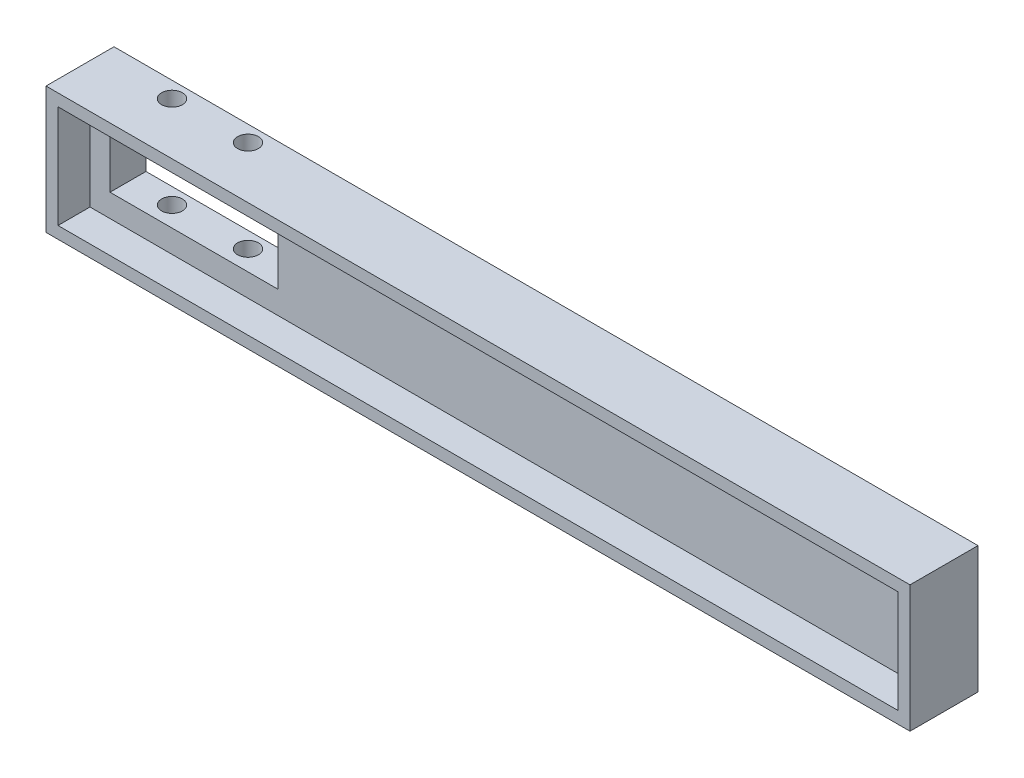
ISO-10303-21;
HEADER;
FILE_DESCRIPTION(('STEP AP214'),'2;1');
FILE_NAME('part.step','',(''),(''),'','','');
FILE_SCHEMA(('AUTOMOTIVE_DESIGN { 1 0 10303 214 1 1 1 1 }'));
ENDSEC;
DATA;
#1=APPLICATION_CONTEXT('core data for automotive mechanical design processes');
#2=APPLICATION_PROTOCOL_DEFINITION('international standard','automotive_design',2000,#1);
#3=PRODUCT_CONTEXT('',#1,'mechanical');
#4=PRODUCT('Part','Part','',(#3));
#5=PRODUCT_RELATED_PRODUCT_CATEGORY('part','',(#4));
#6=PRODUCT_DEFINITION_FORMATION('','',#4);
#7=PRODUCT_DEFINITION_CONTEXT('part definition',#1,'design');
#8=PRODUCT_DEFINITION('design','',#6,#7);
#9=PRODUCT_DEFINITION_SHAPE('','',#8);
#10=(LENGTH_UNIT() NAMED_UNIT(*) SI_UNIT(.MILLI.,.METRE.));
#11=(NAMED_UNIT(*) PLANE_ANGLE_UNIT() SI_UNIT($,.RADIAN.));
#12=(NAMED_UNIT(*) SI_UNIT($,.STERADIAN.) SOLID_ANGLE_UNIT());
#13=UNCERTAINTY_MEASURE_WITH_UNIT(LENGTH_MEASURE(1.E-05),#10,'distance_accuracy_value','');
#14=(GEOMETRIC_REPRESENTATION_CONTEXT(3) GLOBAL_UNCERTAINTY_ASSIGNED_CONTEXT((#13)) GLOBAL_UNIT_ASSIGNED_CONTEXT((#10,
#11,#12)) REPRESENTATION_CONTEXT('',''));
#15=CARTESIAN_POINT('',(0.,0.,0.));
#16=DIRECTION('',(0.,0.,1.));
#17=DIRECTION('',(1.,0.,0.));
#18=AXIS2_PLACEMENT_3D('',#15,#16,#17);
#19=CARTESIAN_POINT('',(-104.5,0.,-3.5));
#20=DIRECTION('',(-1.,0.,0.));
#21=DIRECTION('',(0.,0.,1.));
#22=AXIS2_PLACEMENT_3D('',#19,#20,#21);
#23=PLANE('',#22);
#24=DIRECTION('',(0.,0.,1.));
#25=VECTOR('',#24,1.);
#26=CARTESIAN_POINT('',(-104.5,4.04114391143853,-3.5));
#27=LINE('',#26,#25);
#28=CARTESIAN_POINT('',(-104.5,4.04114391143853,1.));
#29=VERTEX_POINT('',#28);
#30=CARTESIAN_POINT('',(-104.5,4.04114391143853,5.));
#31=VERTEX_POINT('',#30);
#32=EDGE_CURVE('E11',#29,#31,#27,.T.);
#33=ORIENTED_EDGE('',*,*,#32,.F.);
#34=DIRECTION('',(0.,-1.,0.));
#35=VECTOR('',#34,1.);
#36=CARTESIAN_POINT('',(-104.5,0.,1.));
#37=LINE('',#36,#35);
#38=CARTESIAN_POINT('',(-104.5,16.8911439114385,1.));
#39=VERTEX_POINT('',#38);
#40=EDGE_CURVE('E139',#39,#29,#37,.T.);
#41=ORIENTED_EDGE('',*,*,#40,.F.);
#42=DIRECTION('',(0.,0.,1.));
#43=VECTOR('',#42,1.);
#44=CARTESIAN_POINT('',(-104.5,16.8911439114385,-3.5));
#45=LINE('',#44,#43);
#46=CARTESIAN_POINT('',(-104.5,16.8911439114385,5.));
#47=VERTEX_POINT('',#46);
#48=EDGE_CURVE('E125',#39,#47,#45,.T.);
#49=ORIENTED_EDGE('',*,*,#48,.T.);
#50=DIRECTION('',(0.,-1.,0.));
#51=VECTOR('',#50,1.);
#52=CARTESIAN_POINT('',(-104.5,0.,5.));
#53=LINE('',#52,#51);
#54=EDGE_CURVE('E194',#47,#31,#53,.T.);
#55=ORIENTED_EDGE('',*,*,#54,.T.);
#56=EDGE_LOOP('',(#33,#41,#49,#55));
#57=FACE_BOUND('',#56,.T.);
#58=ADVANCED_FACE('F35',(#57),#23,.F.);
#59=CARTESIAN_POINT('',(0.,4.04114391143857,-3.5));
#60=DIRECTION('',(0.,1.,0.));
#61=DIRECTION('',(-1.,0.,0.));
#62=AXIS2_PLACEMENT_3D('',#59,#60,#61);
#63=PLANE('',#62);
#64=DIRECTION('',(1.,0.,0.));
#65=VECTOR('',#64,1.);
#66=CARTESIAN_POINT('',(0.,4.04114391143861,1.));
#67=LINE('',#66,#65);
#68=CARTESIAN_POINT('',(0.500000000000003,4.04114391143857,1.));
#69=VERTEX_POINT('',#68);
#70=EDGE_CURVE('E51',#29,#69,#67,.T.);
#71=ORIENTED_EDGE('',*,*,#70,.F.);
#72=ORIENTED_EDGE('',*,*,#32,.T.);
#73=DIRECTION('',(-1.,0.,0.));
#74=VECTOR('',#73,1.);
#75=CARTESIAN_POINT('',(0.,4.04114391143857,5.));
#76=LINE('',#75,#74);
#77=CARTESIAN_POINT('',(0.500000000000003,4.04114391143857,5.));
#78=VERTEX_POINT('',#77);
#79=EDGE_CURVE('E200',#78,#31,#76,.T.);
#80=ORIENTED_EDGE('',*,*,#79,.F.);
#81=DIRECTION('',(0.,0.,1.));
#82=VECTOR('',#81,1.);
#83=CARTESIAN_POINT('',(0.500000000000003,4.04114391143857,-3.5));
#84=LINE('',#83,#82);
#85=EDGE_CURVE('E44',#69,#78,#84,.T.);
#86=ORIENTED_EDGE('',*,*,#85,.F.);
#87=EDGE_LOOP('',(#71,#72,#80,#86));
#88=FACE_BOUND('',#87,.T.);
#89=ADVANCED_FACE('F286',(#88),#63,.T.);
#90=CARTESIAN_POINT('',(0.500000000000003,0.,-3.5));
#91=DIRECTION('',(-1.,0.,0.));
#92=DIRECTION('',(0.,-1.,0.));
#93=AXIS2_PLACEMENT_3D('',#90,#91,#92);
#94=PLANE('',#93);
#95=DIRECTION('',(0.,-1.,0.));
#96=VECTOR('',#95,1.);
#97=CARTESIAN_POINT('',(0.500000000000003,0.,1.));
#98=LINE('',#97,#96);
#99=CARTESIAN_POINT('',(0.5,16.8911439114385,1.));
#100=VERTEX_POINT('',#99);
#101=EDGE_CURVE('E59',#100,#69,#98,.T.);
#102=ORIENTED_EDGE('',*,*,#101,.T.);
#103=ORIENTED_EDGE('',*,*,#85,.T.);
#104=DIRECTION('',(0.,-1.,0.));
#105=VECTOR('',#104,1.);
#106=CARTESIAN_POINT('',(0.500000000000003,0.,5.));
#107=LINE('',#106,#105);
#108=CARTESIAN_POINT('',(0.5,16.8911439114385,5.));
#109=VERTEX_POINT('',#108);
#110=EDGE_CURVE('E197',#109,#78,#107,.T.);
#111=ORIENTED_EDGE('',*,*,#110,.F.);
#112=DIRECTION('',(0.,0.,1.));
#113=VECTOR('',#112,1.);
#114=CARTESIAN_POINT('',(0.5,16.8911439114385,-3.5));
#115=LINE('',#114,#113);
#116=EDGE_CURVE('E135',#100,#109,#115,.T.);
#117=ORIENTED_EDGE('',*,*,#116,.F.);
#118=EDGE_LOOP('',(#102,#103,#111,#117));
#119=FACE_BOUND('',#118,.T.);
#120=ADVANCED_FACE('F291',(#119),#94,.T.);
#121=CARTESIAN_POINT('',(0.,18.3911439114386,-3.5));
#122=DIRECTION('',(0.,-1.,0.));
#123=DIRECTION('',(1.,0.,0.));
#124=AXIS2_PLACEMENT_3D('',#121,#122,#123);
#125=PLANE('',#124);
#126=CARTESIAN_POINT('',(-87.25,18.3911439114386,-1.5));
#127=DIRECTION('',(0.,1.,0.));
#128=DIRECTION('',(-1.,0.,0.));
#129=AXIS2_PLACEMENT_3D('',#126,#127,#128);
#130=CIRCLE('',#129,1.29999999999999);
#131=CARTESIAN_POINT('',(-88.55,18.3911439114386,-1.5));
#132=VERTEX_POINT('',#131);
#133=EDGE_CURVE('E236',#132,#132,#130,.F.);
#134=ORIENTED_EDGE('',*,*,#133,.T.);
#135=EDGE_LOOP('',(#134));
#136=FACE_BOUND('',#135,.T.);
#137=CARTESIAN_POINT('',(-96.75,18.3911439114386,-1.5));
#138=DIRECTION('',(0.,1.,0.));
#139=DIRECTION('',(-1.,0.,0.));
#140=AXIS2_PLACEMENT_3D('',#137,#138,#139);
#141=CIRCLE('',#140,1.29999999999999);
#142=CARTESIAN_POINT('',(-98.05,18.3911439114386,-1.5));
#143=VERTEX_POINT('',#142);
#144=EDGE_CURVE('E227',#143,#143,#141,.F.);
#145=ORIENTED_EDGE('',*,*,#144,.T.);
#146=EDGE_LOOP('',(#145));
#147=FACE_BOUND('',#146,.T.);
#148=DIRECTION('',(0.,0.,1.));
#149=VECTOR('',#148,1.);
#150=CARTESIAN_POINT('',(-106.,18.3911439114385,-3.5));
#151=LINE('',#150,#149);
#152=CARTESIAN_POINT('',(-106.,18.3911439114385,-3.5));
#153=VERTEX_POINT('',#152);
#154=CARTESIAN_POINT('',(-106.,18.3911439114385,5.));
#155=VERTEX_POINT('',#154);
#156=EDGE_CURVE('E213',#153,#155,#151,.T.);
#157=ORIENTED_EDGE('',*,*,#156,.T.);
#158=DIRECTION('',(1.,0.,0.));
#159=VECTOR('',#158,1.);
#160=CARTESIAN_POINT('',(0.,18.3911439114386,5.));
#161=LINE('',#160,#159);
#162=CARTESIAN_POINT('',(2.,18.3911439114386,5.));
#163=VERTEX_POINT('',#162);
#164=EDGE_CURVE('E177',#155,#163,#161,.T.);
#165=ORIENTED_EDGE('',*,*,#164,.T.);
#166=DIRECTION('',(0.,0.,1.));
#167=VECTOR('',#166,1.);
#168=CARTESIAN_POINT('',(2.,18.3911439114386,-3.5));
#169=LINE('',#168,#167);
#170=CARTESIAN_POINT('',(2.,18.3911439114386,-3.5));
#171=VERTEX_POINT('',#170);
#172=EDGE_CURVE('E136',#171,#163,#169,.T.);
#173=ORIENTED_EDGE('',*,*,#172,.F.);
#174=DIRECTION('',(1.,0.,0.));
#175=VECTOR('',#174,1.);
#176=CARTESIAN_POINT('',(0.,18.3911439114386,-3.5));
#177=LINE('',#176,#175);
#178=EDGE_CURVE('E203',#153,#171,#177,.T.);
#179=ORIENTED_EDGE('',*,*,#178,.F.);
#180=EDGE_LOOP('',(#157,#165,#173,#179));
#181=FACE_BOUND('',#180,.T.);
#182=ADVANCED_FACE('F37',(#136,#147,#181),#125,.F.);
#183=CARTESIAN_POINT('',(2.,0.,-3.5));
#184=DIRECTION('',(-1.,0.,0.));
#185=DIRECTION('',(0.,-1.,0.));
#186=AXIS2_PLACEMENT_3D('',#183,#184,#185);
#187=PLANE('',#186);
#188=ORIENTED_EDGE('',*,*,#172,.T.);
#189=DIRECTION('',(0.,-1.,0.));
#190=VECTOR('',#189,1.);
#191=CARTESIAN_POINT('',(2.,0.,5.));
#192=LINE('',#191,#190);
#193=CARTESIAN_POINT('',(2.,2.54114391143857,5.));
#194=VERTEX_POINT('',#193);
#195=EDGE_CURVE('E191',#163,#194,#192,.T.);
#196=ORIENTED_EDGE('',*,*,#195,.T.);
#197=DIRECTION('',(0.,0.,1.));
#198=VECTOR('',#197,1.);
#199=CARTESIAN_POINT('',(2.,2.54114391143857,-3.5));
#200=LINE('',#199,#198);
#201=CARTESIAN_POINT('',(2.,2.54114391143857,-3.5));
#202=VERTEX_POINT('',#201);
#203=EDGE_CURVE('E218',#202,#194,#200,.T.);
#204=ORIENTED_EDGE('',*,*,#203,.F.);
#205=DIRECTION('',(0.,-1.,0.));
#206=VECTOR('',#205,1.);
#207=CARTESIAN_POINT('',(2.,0.,-3.5));
#208=LINE('',#207,#206);
#209=EDGE_CURVE('E212',#171,#202,#208,.T.);
#210=ORIENTED_EDGE('',*,*,#209,.F.);
#211=EDGE_LOOP('',(#188,#196,#204,#210));
#212=FACE_BOUND('',#211,.T.);
#213=ADVANCED_FACE('F294',(#212),#187,.F.);
#214=CARTESIAN_POINT('',(0.,2.54114391143857,-3.5));
#215=DIRECTION('',(0.,-1.,0.));
#216=DIRECTION('',(1.,0.,0.));
#217=AXIS2_PLACEMENT_3D('',#214,#215,#216);
#218=PLANE('',#217);
#219=CARTESIAN_POINT('',(-87.25,2.54114391143849,-1.5));
#220=DIRECTION('',(0.,1.,0.));
#221=DIRECTION('',(-1.,0.,0.));
#222=AXIS2_PLACEMENT_3D('',#219,#220,#221);
#223=CIRCLE('',#222,1.29999999999999);
#224=CARTESIAN_POINT('',(-88.55,2.54114391143849,-1.5));
#225=VERTEX_POINT('',#224);
#226=EDGE_CURVE('E239',#225,#225,#223,.F.);
#227=ORIENTED_EDGE('',*,*,#226,.F.);
#228=EDGE_LOOP('',(#227));
#229=FACE_BOUND('',#228,.T.);
#230=CARTESIAN_POINT('',(-96.75,2.54114391143848,-1.5));
#231=DIRECTION('',(0.,1.,0.));
#232=DIRECTION('',(-1.,0.,0.));
#233=AXIS2_PLACEMENT_3D('',#230,#231,#232);
#234=CIRCLE('',#233,1.29999999999999);
#235=CARTESIAN_POINT('',(-98.05,2.54114391143848,-1.5));
#236=VERTEX_POINT('',#235);
#237=EDGE_CURVE('E223',#236,#236,#234,.F.);
#238=ORIENTED_EDGE('',*,*,#237,.F.);
#239=EDGE_LOOP('',(#238));
#240=FACE_BOUND('',#239,.T.);
#241=ORIENTED_EDGE('',*,*,#203,.T.);
#242=DIRECTION('',(1.,0.,0.));
#243=VECTOR('',#242,1.);
#244=CARTESIAN_POINT('',(0.,2.54114391143857,5.));
#245=LINE('',#244,#243);
#246=CARTESIAN_POINT('',(-106.,2.54114391143853,5.));
#247=VERTEX_POINT('',#246);
#248=EDGE_CURVE('E188',#247,#194,#245,.T.);
#249=ORIENTED_EDGE('',*,*,#248,.F.);
#250=DIRECTION('',(0.,0.,1.));
#251=VECTOR('',#250,1.);
#252=CARTESIAN_POINT('',(-106.,2.54114391143853,-3.5));
#253=LINE('',#252,#251);
#254=CARTESIAN_POINT('',(-106.,2.54114391143853,-3.5));
#255=VERTEX_POINT('',#254);
#256=EDGE_CURVE('E220',#255,#247,#253,.T.);
#257=ORIENTED_EDGE('',*,*,#256,.F.);
#258=DIRECTION('',(1.,0.,0.));
#259=VECTOR('',#258,1.);
#260=CARTESIAN_POINT('',(0.,2.54114391143857,-3.5));
#261=LINE('',#260,#259);
#262=EDGE_CURVE('E209',#255,#202,#261,.T.);
#263=ORIENTED_EDGE('',*,*,#262,.T.);
#264=EDGE_LOOP('',(#241,#249,#257,#263));
#265=FACE_BOUND('',#264,.T.);
#266=ADVANCED_FACE('F297',(#229,#240,#265),#218,.T.);
#267=CARTESIAN_POINT('',(-106.,0.,-3.5));
#268=DIRECTION('',(-1.,0.,0.));
#269=DIRECTION('',(0.,0.,1.));
#270=AXIS2_PLACEMENT_3D('',#267,#268,#269);
#271=PLANE('',#270);
#272=ORIENTED_EDGE('',*,*,#256,.T.);
#273=DIRECTION('',(0.,-1.,0.));
#274=VECTOR('',#273,1.);
#275=CARTESIAN_POINT('',(-106.,0.,5.));
#276=LINE('',#275,#274);
#277=EDGE_CURVE('E185',#155,#247,#276,.T.);
#278=ORIENTED_EDGE('',*,*,#277,.F.);
#279=ORIENTED_EDGE('',*,*,#156,.F.);
#280=DIRECTION('',(0.,-1.,0.));
#281=VECTOR('',#280,1.);
#282=CARTESIAN_POINT('',(-106.,0.,-3.5));
#283=LINE('',#282,#281);
#284=EDGE_CURVE('E206',#153,#255,#283,.T.);
#285=ORIENTED_EDGE('',*,*,#284,.T.);
#286=EDGE_LOOP('',(#272,#278,#279,#285));
#287=FACE_BOUND('',#286,.T.);
#288=ADVANCED_FACE('F282',(#287),#271,.T.);
#289=CARTESIAN_POINT('',(0.,16.8911439114383,-3.5));
#290=DIRECTION('',(0.,-1.,0.));
#291=DIRECTION('',(1.,0.,0.));
#292=AXIS2_PLACEMENT_3D('',#289,#290,#291);
#293=PLANE('',#292);
#294=DIRECTION('',(1.,0.,0.));
#295=VECTOR('',#294,1.);
#296=CARTESIAN_POINT('',(0.,16.8911439114383,1.));
#297=LINE('',#296,#295);
#298=EDGE_CURVE('E129',#39,#100,#297,.T.);
#299=ORIENTED_EDGE('',*,*,#298,.T.);
#300=ORIENTED_EDGE('',*,*,#116,.T.);
#301=DIRECTION('',(1.,0.,0.));
#302=VECTOR('',#301,1.);
#303=CARTESIAN_POINT('',(0.,16.8911439114383,5.));
#304=LINE('',#303,#302);
#305=EDGE_CURVE('E131',#47,#109,#304,.T.);
#306=ORIENTED_EDGE('',*,*,#305,.F.);
#307=ORIENTED_EDGE('',*,*,#48,.F.);
#308=EDGE_LOOP('',(#299,#300,#306,#307));
#309=FACE_BOUND('',#308,.T.);
#310=ADVANCED_FACE('F127',(#309),#293,.T.);
#311=CARTESIAN_POINT('',(0.,0.,-3.5));
#312=DIRECTION('',(0.,0.,1.));
#313=DIRECTION('',(1.,0.,0.));
#314=AXIS2_PLACEMENT_3D('',#311,#312,#313);
#315=PLANE('',#314);
#316=ORIENTED_EDGE('',*,*,#178,.T.);
#317=ORIENTED_EDGE('',*,*,#209,.T.);
#318=ORIENTED_EDGE('',*,*,#262,.F.);
#319=ORIENTED_EDGE('',*,*,#284,.F.);
#320=EDGE_LOOP('',(#316,#317,#318,#319));
#321=FACE_BOUND('',#320,.T.);
#322=DIRECTION('',(0.,1.,0.));
#323=VECTOR('',#322,1.);
#324=CARTESIAN_POINT('',(-81.0000000000001,0.,-3.5));
#325=LINE('',#324,#323);
#326=CARTESIAN_POINT('',(-81.0000000000001,6.89114391143846,-3.5));
#327=VERTEX_POINT('',#326);
#328=CARTESIAN_POINT('',(-81.0000000000001,14.3911439114385,-3.5));
#329=VERTEX_POINT('',#328);
#330=EDGE_CURVE('E165',#327,#329,#325,.T.);
#331=ORIENTED_EDGE('',*,*,#330,.T.);
#332=DIRECTION('',(1.,0.,0.));
#333=VECTOR('',#332,1.);
#334=CARTESIAN_POINT('',(0.,14.3911439114385,-3.5));
#335=LINE('',#334,#333);
#336=CARTESIAN_POINT('',(-102.,14.3911439114385,-3.5));
#337=VERTEX_POINT('',#336);
#338=EDGE_CURVE('E171',#337,#329,#335,.T.);
#339=ORIENTED_EDGE('',*,*,#338,.F.);
#340=DIRECTION('',(0.,-1.,0.));
#341=VECTOR('',#340,1.);
#342=CARTESIAN_POINT('',(-102.,0.,-3.5));
#343=LINE('',#342,#341);
#344=CARTESIAN_POINT('',(-102.,6.89114391143846,-3.5));
#345=VERTEX_POINT('',#344);
#346=EDGE_CURVE('E169',#337,#345,#343,.T.);
#347=ORIENTED_EDGE('',*,*,#346,.T.);
#348=DIRECTION('',(1.,0.,0.));
#349=VECTOR('',#348,1.);
#350=CARTESIAN_POINT('',(0.,6.89114391143847,-3.5));
#351=LINE('',#350,#349);
#352=EDGE_CURVE('E167',#345,#327,#351,.T.);
#353=ORIENTED_EDGE('',*,*,#352,.T.);
#354=EDGE_LOOP('',(#331,#339,#347,#353));
#355=FACE_BOUND('',#354,.T.);
#356=ADVANCED_FACE('F271',(#321,#355),#315,.F.);
#357=CARTESIAN_POINT('',(0.,0.,5.));
#358=DIRECTION('',(0.,0.,1.));
#359=DIRECTION('',(1.,0.,0.));
#360=AXIS2_PLACEMENT_3D('',#357,#358,#359);
#361=PLANE('',#360);
#362=ORIENTED_EDGE('',*,*,#164,.F.);
#363=ORIENTED_EDGE('',*,*,#277,.T.);
#364=ORIENTED_EDGE('',*,*,#248,.T.);
#365=ORIENTED_EDGE('',*,*,#195,.F.);
#366=EDGE_LOOP('',(#362,#363,#364,#365));
#367=FACE_BOUND('',#366,.T.);
#368=ORIENTED_EDGE('',*,*,#54,.F.);
#369=ORIENTED_EDGE('',*,*,#305,.T.);
#370=ORIENTED_EDGE('',*,*,#110,.T.);
#371=ORIENTED_EDGE('',*,*,#79,.T.);
#372=EDGE_LOOP('',(#368,#369,#370,#371));
#373=FACE_BOUND('',#372,.T.);
#374=ADVANCED_FACE('F273',(#367,#373),#361,.T.);
#375=CARTESIAN_POINT('',(-81.0000000000001,0.,-3.5));
#376=DIRECTION('',(1.,0.,0.));
#377=DIRECTION('',(0.,0.,-1.));
#378=AXIS2_PLACEMENT_3D('',#375,#376,#377);
#379=PLANE('',#378);
#380=DIRECTION('',(0.,0.,1.));
#381=VECTOR('',#380,1.);
#382=CARTESIAN_POINT('',(-81.0000000000001,6.89114391143846,-3.5));
#383=LINE('',#382,#381);
#384=CARTESIAN_POINT('',(-81.0000000000001,6.89114391143846,1.));
#385=VERTEX_POINT('',#384);
#386=EDGE_CURVE('E174',#327,#385,#383,.T.);
#387=ORIENTED_EDGE('',*,*,#386,.T.);
#388=DIRECTION('',(0.,1.,0.));
#389=VECTOR('',#388,1.);
#390=CARTESIAN_POINT('',(-81.0000000000001,0.,1.));
#391=LINE('',#390,#389);
#392=CARTESIAN_POINT('',(-81.0000000000001,14.3911439114385,1.));
#393=VERTEX_POINT('',#392);
#394=EDGE_CURVE('E153',#385,#393,#391,.T.);
#395=ORIENTED_EDGE('',*,*,#394,.T.);
#396=DIRECTION('',(0.,0.,1.));
#397=VECTOR('',#396,1.);
#398=CARTESIAN_POINT('',(-81.0000000000001,14.3911439114385,-3.5));
#399=LINE('',#398,#397);
#400=EDGE_CURVE('E175',#329,#393,#399,.T.);
#401=ORIENTED_EDGE('',*,*,#400,.F.);
#402=ORIENTED_EDGE('',*,*,#330,.F.);
#403=EDGE_LOOP('',(#387,#395,#401,#402));
#404=FACE_BOUND('',#403,.T.);
#405=ADVANCED_FACE('F268',(#404),#379,.F.);
#406=CARTESIAN_POINT('',(0.,14.3911439114385,-3.5));
#407=DIRECTION('',(0.,-1.,0.));
#408=DIRECTION('',(0.,0.,-1.));
#409=AXIS2_PLACEMENT_3D('',#406,#407,#408);
#410=PLANE('',#409);
#411=CARTESIAN_POINT('',(-87.25,14.3911439114385,-1.5));
#412=DIRECTION('',(0.,-1.,0.));
#413=DIRECTION('',(0.,0.,-1.));
#414=AXIS2_PLACEMENT_3D('',#411,#412,#413);
#415=CIRCLE('',#414,1.29999999999999);
#416=CARTESIAN_POINT('',(-87.25,14.3911439114385,-2.8));
#417=VERTEX_POINT('',#416);
#418=EDGE_CURVE('E232',#417,#417,#415,.F.);
#419=ORIENTED_EDGE('',*,*,#418,.T.);
#420=EDGE_LOOP('',(#419));
#421=FACE_BOUND('',#420,.T.);
#422=CARTESIAN_POINT('',(-96.75,14.3911439114385,-1.5));
#423=DIRECTION('',(0.,-1.,0.));
#424=DIRECTION('',(0.,0.,-1.));
#425=AXIS2_PLACEMENT_3D('',#422,#423,#424);
#426=CIRCLE('',#425,1.29999999999999);
#427=CARTESIAN_POINT('',(-96.75,14.3911439114385,-2.8));
#428=VERTEX_POINT('',#427);
#429=EDGE_CURVE('E144',#428,#428,#426,.F.);
#430=ORIENTED_EDGE('',*,*,#429,.T.);
#431=EDGE_LOOP('',(#430));
#432=FACE_BOUND('',#431,.T.);
#433=ORIENTED_EDGE('',*,*,#400,.T.);
#434=DIRECTION('',(1.,0.,0.));
#435=VECTOR('',#434,1.);
#436=CARTESIAN_POINT('',(0.,14.3911439114385,1.));
#437=LINE('',#436,#435);
#438=CARTESIAN_POINT('',(-102.,14.3911439114385,1.));
#439=VERTEX_POINT('',#438);
#440=EDGE_CURVE('E162',#439,#393,#437,.T.);
#441=ORIENTED_EDGE('',*,*,#440,.F.);
#442=DIRECTION('',(0.,0.,1.));
#443=VECTOR('',#442,1.);
#444=CARTESIAN_POINT('',(-102.,14.3911439114385,-3.5));
#445=LINE('',#444,#443);
#446=EDGE_CURVE('E178',#337,#439,#445,.T.);
#447=ORIENTED_EDGE('',*,*,#446,.F.);
#448=ORIENTED_EDGE('',*,*,#338,.T.);
#449=EDGE_LOOP('',(#433,#441,#447,#448));
#450=FACE_BOUND('',#449,.T.);
#451=ADVANCED_FACE('F265',(#421,#432,#450),#410,.T.);
#452=CARTESIAN_POINT('',(-102.,0.,-3.5));
#453=DIRECTION('',(-1.,0.,0.));
#454=DIRECTION('',(0.,0.,1.));
#455=AXIS2_PLACEMENT_3D('',#452,#453,#454);
#456=PLANE('',#455);
#457=ORIENTED_EDGE('',*,*,#446,.T.);
#458=DIRECTION('',(0.,-1.,0.));
#459=VECTOR('',#458,1.);
#460=CARTESIAN_POINT('',(-102.,0.,1.));
#461=LINE('',#460,#459);
#462=CARTESIAN_POINT('',(-102.,6.89114391143846,1.));
#463=VERTEX_POINT('',#462);
#464=EDGE_CURVE('E159',#439,#463,#461,.T.);
#465=ORIENTED_EDGE('',*,*,#464,.T.);
#466=DIRECTION('',(0.,0.,1.));
#467=VECTOR('',#466,1.);
#468=CARTESIAN_POINT('',(-102.,6.89114391143846,-3.5));
#469=LINE('',#468,#467);
#470=EDGE_CURVE('E180',#345,#463,#469,.T.);
#471=ORIENTED_EDGE('',*,*,#470,.F.);
#472=ORIENTED_EDGE('',*,*,#346,.F.);
#473=EDGE_LOOP('',(#457,#465,#471,#472));
#474=FACE_BOUND('',#473,.T.);
#475=ADVANCED_FACE('F251',(#474),#456,.F.);
#476=CARTESIAN_POINT('',(0.,6.89114391143847,-3.5));
#477=DIRECTION('',(0.,-1.,0.));
#478=DIRECTION('',(1.,0.,0.));
#479=AXIS2_PLACEMENT_3D('',#476,#477,#478);
#480=PLANE('',#479);
#481=CARTESIAN_POINT('',(-87.25,6.89114391143846,-1.5));
#482=DIRECTION('',(0.,-1.,0.));
#483=DIRECTION('',(1.,0.,0.));
#484=AXIS2_PLACEMENT_3D('',#481,#482,#483);
#485=CIRCLE('',#484,1.29999999999999);
#486=CARTESIAN_POINT('',(-85.95,6.89114391143846,-1.5));
#487=VERTEX_POINT('',#486);
#488=EDGE_CURVE('E39',#487,#487,#485,.F.);
#489=ORIENTED_EDGE('',*,*,#488,.F.);
#490=EDGE_LOOP('',(#489));
#491=FACE_BOUND('',#490,.T.);
#492=CARTESIAN_POINT('',(-96.75,6.89114391143846,-1.5));
#493=DIRECTION('',(0.,-1.,0.));
#494=DIRECTION('',(1.,0.,0.));
#495=AXIS2_PLACEMENT_3D('',#492,#493,#494);
#496=CIRCLE('',#495,1.29999999999999);
#497=CARTESIAN_POINT('',(-95.45,6.89114391143846,-1.5));
#498=VERTEX_POINT('',#497);
#499=EDGE_CURVE('E147',#498,#498,#496,.F.);
#500=ORIENTED_EDGE('',*,*,#499,.F.);
#501=EDGE_LOOP('',(#500));
#502=FACE_BOUND('',#501,.T.);
#503=ORIENTED_EDGE('',*,*,#470,.T.);
#504=DIRECTION('',(1.,0.,0.));
#505=VECTOR('',#504,1.);
#506=CARTESIAN_POINT('',(0.,6.89114391143847,1.));
#507=LINE('',#506,#505);
#508=EDGE_CURVE('E156',#463,#385,#507,.T.);
#509=ORIENTED_EDGE('',*,*,#508,.T.);
#510=ORIENTED_EDGE('',*,*,#386,.F.);
#511=ORIENTED_EDGE('',*,*,#352,.F.);
#512=EDGE_LOOP('',(#503,#509,#510,#511));
#513=FACE_BOUND('',#512,.T.);
#514=ADVANCED_FACE('F248',(#491,#502,#513),#480,.F.);
#515=CARTESIAN_POINT('',(0.,0.,1.));
#516=DIRECTION('',(0.,0.,1.));
#517=DIRECTION('',(1.,0.,0.));
#518=AXIS2_PLACEMENT_3D('',#515,#516,#517);
#519=PLANE('',#518);
#520=ORIENTED_EDGE('',*,*,#298,.F.);
#521=ORIENTED_EDGE('',*,*,#40,.T.);
#522=ORIENTED_EDGE('',*,*,#70,.T.);
#523=ORIENTED_EDGE('',*,*,#101,.F.);
#524=EDGE_LOOP('',(#520,#521,#522,#523));
#525=FACE_BOUND('',#524,.T.);
#526=ORIENTED_EDGE('',*,*,#394,.F.);
#527=ORIENTED_EDGE('',*,*,#508,.F.);
#528=ORIENTED_EDGE('',*,*,#464,.F.);
#529=ORIENTED_EDGE('',*,*,#440,.T.);
#530=EDGE_LOOP('',(#526,#527,#528,#529));
#531=FACE_BOUND('',#530,.T.);
#532=ADVANCED_FACE('F142',(#525,#531),#519,.T.);
#533=CARTESIAN_POINT('',(-96.75,2.54114391143848,-1.5));
#534=DIRECTION('',(0.,1.,0.));
#535=DIRECTION('',(-1.,0.,0.));
#536=AXIS2_PLACEMENT_3D('',#533,#534,#535);
#537=CYLINDRICAL_SURFACE('',#536,1.29999999999999);
#538=ORIENTED_EDGE('',*,*,#237,.T.);
#539=EDGE_LOOP('',(#538));
#540=FACE_BOUND('',#539,.T.);
#541=ORIENTED_EDGE('',*,*,#499,.T.);
#542=EDGE_LOOP('',(#541));
#543=FACE_BOUND('',#542,.T.);
#544=ADVANCED_FACE('F328',(#540,#543),#537,.F.);
#545=ORIENTED_EDGE('',*,*,#429,.F.);
#546=EDGE_LOOP('',(#545));
#547=FACE_BOUND('',#546,.T.);
#548=ORIENTED_EDGE('',*,*,#144,.F.);
#549=EDGE_LOOP('',(#548));
#550=FACE_BOUND('',#549,.T.);
#551=ADVANCED_FACE('F326',(#547,#550),#537,.F.);
#552=CARTESIAN_POINT('',(-87.25,2.54114391143849,-1.5));
#553=DIRECTION('',(0.,1.,0.));
#554=DIRECTION('',(-1.,0.,0.));
#555=AXIS2_PLACEMENT_3D('',#552,#553,#554);
#556=CYLINDRICAL_SURFACE('',#555,1.29999999999999);
#557=ORIENTED_EDGE('',*,*,#226,.T.);
#558=EDGE_LOOP('',(#557));
#559=FACE_BOUND('',#558,.T.);
#560=ORIENTED_EDGE('',*,*,#488,.T.);
#561=EDGE_LOOP('',(#560));
#562=FACE_BOUND('',#561,.T.);
#563=ADVANCED_FACE('F246',(#559,#562),#556,.F.);
#564=ORIENTED_EDGE('',*,*,#418,.F.);
#565=EDGE_LOOP('',(#564));
#566=FACE_BOUND('',#565,.T.);
#567=ORIENTED_EDGE('',*,*,#133,.F.);
#568=EDGE_LOOP('',(#567));
#569=FACE_BOUND('',#568,.T.);
#570=ADVANCED_FACE('F335',(#566,#569),#556,.F.);
#571=CLOSED_SHELL('',(#58,#89,#120,#182,#213,#266,#288,#310,#356,#374,#405,#451,#475,#514,#532,
#544,#551,#563,#570));
#572=MANIFOLD_SOLID_BREP('B2',#571);
#573=ADVANCED_BREP_SHAPE_REPRESENTATION('',(#18,#572),#14);
#574=SHAPE_DEFINITION_REPRESENTATION(#9,#573);
ENDSEC;
END-ISO-10303-21;
